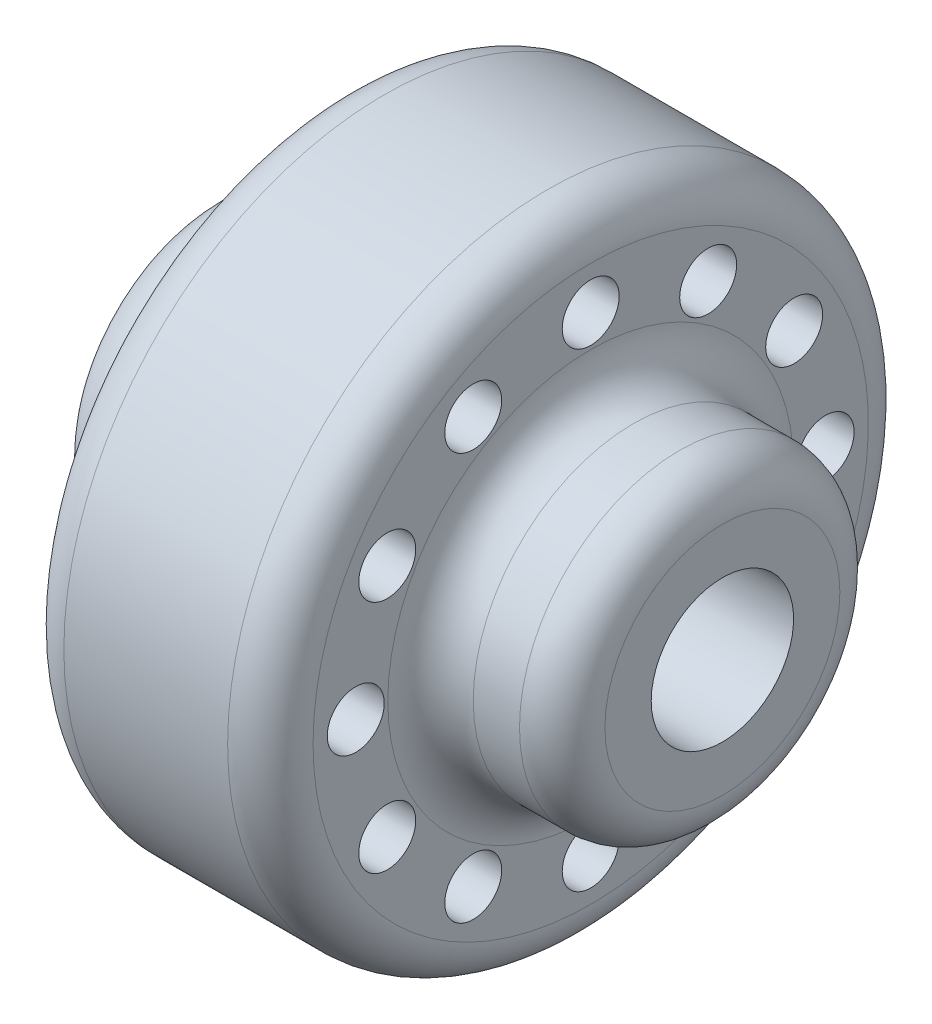
ISO-10303-21;
HEADER;
FILE_DESCRIPTION(('STEP AP214'),'2;1');
FILE_NAME('part.step','',(''),(''),'','','');
FILE_SCHEMA(('AUTOMOTIVE_DESIGN { 1 0 10303 214 1 1 1 1 }'));
ENDSEC;
DATA;
#1=APPLICATION_CONTEXT('core data for automotive mechanical design processes');
#2=APPLICATION_PROTOCOL_DEFINITION('international standard','automotive_design',2000,#1);
#3=PRODUCT_CONTEXT('',#1,'mechanical');
#4=PRODUCT('Part','Part','',(#3));
#5=PRODUCT_RELATED_PRODUCT_CATEGORY('part','',(#4));
#6=PRODUCT_DEFINITION_FORMATION('','',#4);
#7=PRODUCT_DEFINITION_CONTEXT('part definition',#1,'design');
#8=PRODUCT_DEFINITION('design','',#6,#7);
#9=PRODUCT_DEFINITION_SHAPE('','',#8);
#10=(LENGTH_UNIT() NAMED_UNIT(*) SI_UNIT(.MILLI.,.METRE.));
#11=(NAMED_UNIT(*) PLANE_ANGLE_UNIT() SI_UNIT($,.RADIAN.));
#12=(NAMED_UNIT(*) SI_UNIT($,.STERADIAN.) SOLID_ANGLE_UNIT());
#13=UNCERTAINTY_MEASURE_WITH_UNIT(LENGTH_MEASURE(1.E-05),#10,'distance_accuracy_value','');
#14=(GEOMETRIC_REPRESENTATION_CONTEXT(3) GLOBAL_UNCERTAINTY_ASSIGNED_CONTEXT((#13)) GLOBAL_UNIT_ASSIGNED_CONTEXT((#10,
#11,#12)) REPRESENTATION_CONTEXT('',''));
#15=CARTESIAN_POINT('',(0.,0.,0.));
#16=DIRECTION('',(0.,0.,1.));
#17=DIRECTION('',(1.,0.,0.));
#18=AXIS2_PLACEMENT_3D('',#15,#16,#17);
#19=CARTESIAN_POINT('',(26.75,8.25,0.));
#20=DIRECTION('',(-1.,0.,0.));
#21=DIRECTION('',(0.,0.,1.));
#22=AXIS2_PLACEMENT_3D('',#19,#20,#21);
#23=PLANE('',#22);
#24=CARTESIAN_POINT('',(26.75,0.,0.));
#25=DIRECTION('',(-1.,0.,0.));
#26=DIRECTION('',(0.,0.,1.));
#27=AXIS2_PLACEMENT_3D('',#24,#25,#26);
#28=CIRCLE('',#27,5.);
#29=CARTESIAN_POINT('',(26.75,0.,5.));
#30=VERTEX_POINT('',#29);
#31=EDGE_CURVE('E74',#30,#30,#28,.T.);
#32=ORIENTED_EDGE('',*,*,#31,.T.);
#33=EDGE_LOOP('',(#32));
#34=FACE_BOUND('',#33,.T.);
#35=CARTESIAN_POINT('',(26.75,0.,0.));
#36=DIRECTION('',(-1.,0.,0.));
#37=DIRECTION('',(0.,0.,1.));
#38=AXIS2_PLACEMENT_3D('',#35,#36,#37);
#39=CIRCLE('',#38,8.25);
#40=CARTESIAN_POINT('',(26.75,0.,8.25));
#41=VERTEX_POINT('',#40);
#42=EDGE_CURVE('E10',#41,#41,#39,.T.);
#43=ORIENTED_EDGE('',*,*,#42,.F.);
#44=EDGE_LOOP('',(#43));
#45=FACE_BOUND('',#44,.T.);
#46=ADVANCED_FACE('F31',(#34,#45),#23,.F.);
#47=CARTESIAN_POINT('',(23.75,0.,0.));
#48=DIRECTION('',(-1.,0.,0.));
#49=DIRECTION('',(0.,0.,1.));
#50=AXIS2_PLACEMENT_3D('',#47,#48,#49);
#51=TOROIDAL_SURFACE('',#50,8.25,3.);
#52=CARTESIAN_POINT('',(23.75,0.,0.));
#53=DIRECTION('',(-1.,0.,0.));
#54=DIRECTION('',(0.,0.,1.));
#55=AXIS2_PLACEMENT_3D('',#52,#53,#54);
#56=CIRCLE('',#55,11.25);
#57=CARTESIAN_POINT('',(23.75,0.,11.25));
#58=VERTEX_POINT('',#57);
#59=EDGE_CURVE('E37',#58,#58,#56,.T.);
#60=ORIENTED_EDGE('',*,*,#59,.F.);
#61=EDGE_LOOP('',(#60));
#62=FACE_BOUND('',#61,.T.);
#63=ORIENTED_EDGE('',*,*,#42,.T.);
#64=EDGE_LOOP('',(#63));
#65=FACE_BOUND('',#64,.T.);
#66=ADVANCED_FACE('F205',(#62,#65),#51,.T.);
#67=CARTESIAN_POINT('',(25.,0.,0.));
#68=DIRECTION('',(-1.,0.,0.));
#69=DIRECTION('',(0.,0.,1.));
#70=AXIS2_PLACEMENT_3D('',#67,#68,#69);
#71=CYLINDRICAL_SURFACE('',#70,11.25);
#72=CARTESIAN_POINT('',(20.5,0.,0.));
#73=DIRECTION('',(-1.,0.,0.));
#74=DIRECTION('',(0.,0.,1.));
#75=AXIS2_PLACEMENT_3D('',#72,#73,#74);
#76=CIRCLE('',#75,11.25);
#77=CARTESIAN_POINT('',(20.5,0.,11.25));
#78=VERTEX_POINT('',#77);
#79=EDGE_CURVE('E41',#78,#78,#76,.T.);
#80=ORIENTED_EDGE('',*,*,#79,.F.);
#81=EDGE_LOOP('',(#80));
#82=FACE_BOUND('',#81,.T.);
#83=ORIENTED_EDGE('',*,*,#59,.T.);
#84=EDGE_LOOP('',(#83));
#85=FACE_BOUND('',#84,.T.);
#86=ADVANCED_FACE('F200',(#82,#85),#71,.T.);
#87=CARTESIAN_POINT('',(20.5,0.,0.));
#88=DIRECTION('',(-1.,0.,0.));
#89=DIRECTION('',(0.,0.,1.));
#90=AXIS2_PLACEMENT_3D('',#87,#88,#89);
#91=TOROIDAL_SURFACE('',#90,14.25,3.);
#92=CARTESIAN_POINT('',(17.5,0.,0.));
#93=DIRECTION('',(-1.,0.,0.));
#94=DIRECTION('',(0.,0.,1.));
#95=AXIS2_PLACEMENT_3D('',#92,#93,#94);
#96=CIRCLE('',#95,14.25);
#97=CARTESIAN_POINT('',(17.5,0.,14.25));
#98=VERTEX_POINT('',#97);
#99=EDGE_CURVE('E45',#98,#98,#96,.T.);
#100=ORIENTED_EDGE('',*,*,#99,.F.);
#101=EDGE_LOOP('',(#100));
#102=FACE_BOUND('',#101,.T.);
#103=ORIENTED_EDGE('',*,*,#79,.T.);
#104=EDGE_LOOP('',(#103));
#105=FACE_BOUND('',#104,.T.);
#106=ADVANCED_FACE('F193',(#102,#105),#91,.F.);
#107=CARTESIAN_POINT('',(17.5,19.5,0.));
#108=DIRECTION('',(-1.,0.,0.));
#109=DIRECTION('',(0.,0.,1.));
#110=AXIS2_PLACEMENT_3D('',#107,#108,#109);
#111=PLANE('',#110);
#112=CARTESIAN_POINT('',(17.5,8.24999999999997,-14.2894191624433));
#113=DIRECTION('',(-1.,0.,0.));
#114=DIRECTION('',(0.,0.,1.));
#115=AXIS2_PLACEMENT_3D('',#112,#113,#114);
#116=CIRCLE('',#115,2.);
#117=CARTESIAN_POINT('',(17.5,8.24999999999997,-12.2894191624433));
#118=VERTEX_POINT('',#117);
#119=EDGE_CURVE('E86',#118,#118,#116,.T.);
#120=ORIENTED_EDGE('',*,*,#119,.T.);
#121=EDGE_LOOP('',(#120));
#122=FACE_BOUND('',#121,.T.);
#123=CARTESIAN_POINT('',(17.5,0.,-16.5));
#124=DIRECTION('',(-1.,0.,0.));
#125=DIRECTION('',(0.,0.,1.));
#126=AXIS2_PLACEMENT_3D('',#123,#124,#125);
#127=CIRCLE('',#126,2.);
#128=CARTESIAN_POINT('',(17.5,0.,-14.5));
#129=VERTEX_POINT('',#128);
#130=EDGE_CURVE('E89',#129,#129,#127,.T.);
#131=ORIENTED_EDGE('',*,*,#130,.T.);
#132=EDGE_LOOP('',(#131));
#133=FACE_BOUND('',#132,.T.);
#134=CARTESIAN_POINT('',(17.5,-8.25000000000007,-14.2894191624432));
#135=DIRECTION('',(-1.,0.,0.));
#136=DIRECTION('',(0.,0.,1.));
#137=AXIS2_PLACEMENT_3D('',#134,#135,#136);
#138=CIRCLE('',#137,2.);
#139=CARTESIAN_POINT('',(17.5,-8.25000000000007,-12.2894191624432));
#140=VERTEX_POINT('',#139);
#141=EDGE_CURVE('E92',#140,#140,#138,.T.);
#142=ORIENTED_EDGE('',*,*,#141,.T.);
#143=EDGE_LOOP('',(#142));
#144=FACE_BOUND('',#143,.T.);
#145=CARTESIAN_POINT('',(17.5,-14.2894191624433,-8.24999999999992));
#146=DIRECTION('',(-1.,0.,0.));
#147=DIRECTION('',(0.,0.,1.));
#148=AXIS2_PLACEMENT_3D('',#145,#146,#147);
#149=CIRCLE('',#148,2.);
#150=CARTESIAN_POINT('',(17.5,-14.2894191624433,-6.24999999999992));
#151=VERTEX_POINT('',#150);
#152=EDGE_CURVE('E95',#151,#151,#149,.T.);
#153=ORIENTED_EDGE('',*,*,#152,.T.);
#154=EDGE_LOOP('',(#153));
#155=FACE_BOUND('',#154,.T.);
#156=CARTESIAN_POINT('',(17.5,-16.5,0.));
#157=DIRECTION('',(-1.,0.,0.));
#158=DIRECTION('',(0.,0.,1.));
#159=AXIS2_PLACEMENT_3D('',#156,#157,#158);
#160=CIRCLE('',#159,2.);
#161=CARTESIAN_POINT('',(17.5,-16.5,2.));
#162=VERTEX_POINT('',#161);
#163=EDGE_CURVE('E98',#162,#162,#160,.T.);
#164=ORIENTED_EDGE('',*,*,#163,.T.);
#165=EDGE_LOOP('',(#164));
#166=FACE_BOUND('',#165,.T.);
#167=CARTESIAN_POINT('',(17.5,-14.2894191624432,8.25000000000012));
#168=DIRECTION('',(-1.,0.,0.));
#169=DIRECTION('',(0.,0.,1.));
#170=AXIS2_PLACEMENT_3D('',#167,#168,#169);
#171=CIRCLE('',#170,2.);
#172=CARTESIAN_POINT('',(17.5,-14.2894191624432,10.2500000000001));
#173=VERTEX_POINT('',#172);
#174=EDGE_CURVE('E101',#173,#173,#171,.T.);
#175=ORIENTED_EDGE('',*,*,#174,.T.);
#176=EDGE_LOOP('',(#175));
#177=FACE_BOUND('',#176,.T.);
#178=CARTESIAN_POINT('',(17.5,-8.24999999999987,14.2894191624433));
#179=DIRECTION('',(-1.,0.,0.));
#180=DIRECTION('',(0.,0.,1.));
#181=AXIS2_PLACEMENT_3D('',#178,#179,#180);
#182=CIRCLE('',#181,2.);
#183=CARTESIAN_POINT('',(17.5,-8.24999999999987,16.2894191624433));
#184=VERTEX_POINT('',#183);
#185=EDGE_CURVE('E104',#184,#184,#182,.T.);
#186=ORIENTED_EDGE('',*,*,#185,.T.);
#187=EDGE_LOOP('',(#186));
#188=FACE_BOUND('',#187,.T.);
#189=CARTESIAN_POINT('',(17.5,1.72828326272735E-13,16.5));
#190=DIRECTION('',(-1.,0.,0.));
#191=DIRECTION('',(0.,0.,1.));
#192=AXIS2_PLACEMENT_3D('',#189,#190,#191);
#193=CIRCLE('',#192,2.);
#194=CARTESIAN_POINT('',(17.5,1.72828326272735E-13,18.5));
#195=VERTEX_POINT('',#194);
#196=EDGE_CURVE('E107',#195,#195,#193,.T.);
#197=ORIENTED_EDGE('',*,*,#196,.T.);
#198=EDGE_LOOP('',(#197));
#199=FACE_BOUND('',#198,.T.);
#200=CARTESIAN_POINT('',(17.5,8.25000000000017,14.2894191624431));
#201=DIRECTION('',(-1.,0.,0.));
#202=DIRECTION('',(0.,0.,1.));
#203=AXIS2_PLACEMENT_3D('',#200,#201,#202);
#204=CIRCLE('',#203,2.);
#205=CARTESIAN_POINT('',(17.5,8.25000000000017,16.2894191624431));
#206=VERTEX_POINT('',#205);
#207=EDGE_CURVE('E110',#206,#206,#204,.T.);
#208=ORIENTED_EDGE('',*,*,#207,.T.);
#209=EDGE_LOOP('',(#208));
#210=FACE_BOUND('',#209,.T.);
#211=CARTESIAN_POINT('',(17.5,14.2894191624433,8.24999999999982));
#212=DIRECTION('',(-1.,0.,0.));
#213=DIRECTION('',(0.,0.,1.));
#214=AXIS2_PLACEMENT_3D('',#211,#212,#213);
#215=CIRCLE('',#214,2.);
#216=CARTESIAN_POINT('',(17.5,14.2894191624433,10.2499999999998));
#217=VERTEX_POINT('',#216);
#218=EDGE_CURVE('E113',#217,#217,#215,.T.);
#219=ORIENTED_EDGE('',*,*,#218,.T.);
#220=EDGE_LOOP('',(#219));
#221=FACE_BOUND('',#220,.T.);
#222=CARTESIAN_POINT('',(17.5,14.2894191624432,-8.25000000000002));
#223=DIRECTION('',(-1.,0.,0.));
#224=DIRECTION('',(0.,0.,1.));
#225=AXIS2_PLACEMENT_3D('',#222,#223,#224);
#226=CIRCLE('',#225,2.);
#227=CARTESIAN_POINT('',(17.5,14.2894191624432,-6.25000000000002));
#228=VERTEX_POINT('',#227);
#229=EDGE_CURVE('E116',#228,#228,#226,.T.);
#230=ORIENTED_EDGE('',*,*,#229,.T.);
#231=EDGE_LOOP('',(#230));
#232=FACE_BOUND('',#231,.T.);
#233=CARTESIAN_POINT('',(17.5,16.5,0.));
#234=DIRECTION('',(-1.,0.,0.));
#235=DIRECTION('',(0.,0.,1.));
#236=AXIS2_PLACEMENT_3D('',#233,#234,#235);
#237=CIRCLE('',#236,2.);
#238=CARTESIAN_POINT('',(17.5,16.5,2.));
#239=VERTEX_POINT('',#238);
#240=EDGE_CURVE('E78',#239,#239,#237,.T.);
#241=ORIENTED_EDGE('',*,*,#240,.T.);
#242=EDGE_LOOP('',(#241));
#243=FACE_BOUND('',#242,.T.);
#244=CARTESIAN_POINT('',(17.5,0.,0.));
#245=DIRECTION('',(-1.,0.,0.));
#246=DIRECTION('',(0.,0.,1.));
#247=AXIS2_PLACEMENT_3D('',#244,#245,#246);
#248=CIRCLE('',#247,19.5);
#249=CARTESIAN_POINT('',(17.5,0.,19.5));
#250=VERTEX_POINT('',#249);
#251=EDGE_CURVE('E50',#250,#250,#248,.T.);
#252=ORIENTED_EDGE('',*,*,#251,.F.);
#253=EDGE_LOOP('',(#252));
#254=FACE_BOUND('',#253,.T.);
#255=ORIENTED_EDGE('',*,*,#99,.T.);
#256=EDGE_LOOP('',(#255));
#257=FACE_BOUND('',#256,.T.);
#258=ADVANCED_FACE('F187',(#122,#133,#144,#155,#166,#177,#188,#199,#210,#221,#232,#243,#254,
#257),#111,.F.);
#259=CARTESIAN_POINT('',(14.5,0.,0.));
#260=DIRECTION('',(-1.,0.,0.));
#261=DIRECTION('',(0.,0.,1.));
#262=AXIS2_PLACEMENT_3D('',#259,#260,#261);
#263=TOROIDAL_SURFACE('',#262,19.5,3.);
#264=CARTESIAN_POINT('',(14.5,0.,0.));
#265=DIRECTION('',(-1.,0.,0.));
#266=DIRECTION('',(0.,0.,1.));
#267=AXIS2_PLACEMENT_3D('',#264,#265,#266);
#268=CIRCLE('',#267,22.5);
#269=CARTESIAN_POINT('',(14.5,0.,22.5));
#270=VERTEX_POINT('',#269);
#271=EDGE_CURVE('E53',#270,#270,#268,.T.);
#272=ORIENTED_EDGE('',*,*,#271,.F.);
#273=EDGE_LOOP('',(#272));
#274=FACE_BOUND('',#273,.T.);
#275=ORIENTED_EDGE('',*,*,#251,.T.);
#276=EDGE_LOOP('',(#275));
#277=FACE_BOUND('',#276,.T.);
#278=ADVANCED_FACE('F181',(#274,#277),#263,.T.);
#279=CARTESIAN_POINT('',(25.,0.,0.));
#280=DIRECTION('',(-1.,0.,0.));
#281=DIRECTION('',(0.,0.,1.));
#282=AXIS2_PLACEMENT_3D('',#279,#280,#281);
#283=CYLINDRICAL_SURFACE('',#282,22.5);
#284=CARTESIAN_POINT('',(3.,0.,0.));
#285=DIRECTION('',(-1.,0.,0.));
#286=DIRECTION('',(0.,0.,1.));
#287=AXIS2_PLACEMENT_3D('',#284,#285,#286);
#288=CIRCLE('',#287,22.5);
#289=CARTESIAN_POINT('',(3.,0.,22.5));
#290=VERTEX_POINT('',#289);
#291=EDGE_CURVE('E56',#290,#290,#288,.T.);
#292=ORIENTED_EDGE('',*,*,#291,.F.);
#293=EDGE_LOOP('',(#292));
#294=FACE_BOUND('',#293,.T.);
#295=ORIENTED_EDGE('',*,*,#271,.T.);
#296=EDGE_LOOP('',(#295));
#297=FACE_BOUND('',#296,.T.);
#298=ADVANCED_FACE('F175',(#294,#297),#283,.T.);
#299=CARTESIAN_POINT('',(3.,0.,0.));
#300=DIRECTION('',(-1.,0.,0.));
#301=DIRECTION('',(0.,0.,1.));
#302=AXIS2_PLACEMENT_3D('',#299,#300,#301);
#303=TOROIDAL_SURFACE('',#302,19.5,3.);
#304=CARTESIAN_POINT('',(0.,0.,0.));
#305=DIRECTION('',(-1.,0.,0.));
#306=DIRECTION('',(0.,0.,1.));
#307=AXIS2_PLACEMENT_3D('',#304,#305,#306);
#308=CIRCLE('',#307,19.5);
#309=CARTESIAN_POINT('',(0.,0.,19.5));
#310=VERTEX_POINT('',#309);
#311=EDGE_CURVE('E59',#310,#310,#308,.T.);
#312=ORIENTED_EDGE('',*,*,#311,.F.);
#313=EDGE_LOOP('',(#312));
#314=FACE_BOUND('',#313,.T.);
#315=ORIENTED_EDGE('',*,*,#291,.T.);
#316=EDGE_LOOP('',(#315));
#317=FACE_BOUND('',#316,.T.);
#318=ADVANCED_FACE('F160',(#314,#317),#303,.T.);
#319=CARTESIAN_POINT('',(0.,19.5,0.));
#320=DIRECTION('',(1.,0.,0.));
#321=DIRECTION('',(0.,0.,-1.));
#322=AXIS2_PLACEMENT_3D('',#319,#320,#321);
#323=PLANE('',#322);
#324=CARTESIAN_POINT('',(0.,8.24999999999997,-14.2894191624433));
#325=DIRECTION('',(-1.,0.,0.));
#326=DIRECTION('',(0.,0.86602540378444,0.499999999999998));
#327=AXIS2_PLACEMENT_3D('',#324,#325,#326);
#328=CIRCLE('',#327,2.);
#329=CARTESIAN_POINT('',(0.,9.98205080756885,-13.2894191624433));
#330=VERTEX_POINT('',#329);
#331=EDGE_CURVE('E122',#330,#330,#328,.T.);
#332=ORIENTED_EDGE('',*,*,#331,.F.);
#333=EDGE_LOOP('',(#332));
#334=FACE_BOUND('',#333,.T.);
#335=CARTESIAN_POINT('',(0.,0.,-16.5));
#336=DIRECTION('',(-1.,0.,0.));
#337=DIRECTION('',(0.,1.,0.));
#338=AXIS2_PLACEMENT_3D('',#335,#336,#337);
#339=CIRCLE('',#338,2.);
#340=CARTESIAN_POINT('',(0.,1.99999999999994,-16.5));
#341=VERTEX_POINT('',#340);
#342=EDGE_CURVE('E142',#341,#341,#339,.T.);
#343=ORIENTED_EDGE('',*,*,#342,.F.);
#344=EDGE_LOOP('',(#343));
#345=FACE_BOUND('',#344,.T.);
#346=CARTESIAN_POINT('',(0.,-8.25000000000007,-14.2894191624432));
#347=DIRECTION('',(-1.,0.,0.));
#348=DIRECTION('',(0.,0.866025403784436,-0.500000000000004));
#349=AXIS2_PLACEMENT_3D('',#346,#347,#348);
#350=CIRCLE('',#349,2.);
#351=CARTESIAN_POINT('',(0.,-6.51794919243119,-15.2894191624432));
#352=VERTEX_POINT('',#351);
#353=EDGE_CURVE('E139',#352,#352,#350,.T.);
#354=ORIENTED_EDGE('',*,*,#353,.F.);
#355=EDGE_LOOP('',(#354));
#356=FACE_BOUND('',#355,.T.);
#357=CARTESIAN_POINT('',(0.,-14.2894191624433,-8.24999999999992));
#358=DIRECTION('',(-1.,0.,0.));
#359=DIRECTION('',(0.,0.499999999999995,-0.866025403784442));
#360=AXIS2_PLACEMENT_3D('',#357,#358,#359);
#361=CIRCLE('',#360,2.);
#362=CARTESIAN_POINT('',(0.,-13.2894191624433,-9.9820508075688));
#363=VERTEX_POINT('',#362);
#364=EDGE_CURVE('E136',#363,#363,#361,.T.);
#365=ORIENTED_EDGE('',*,*,#364,.F.);
#366=EDGE_LOOP('',(#365));
#367=FACE_BOUND('',#366,.T.);
#368=CARTESIAN_POINT('',(0.,-16.5,0.));
#369=DIRECTION('',(-1.,0.,0.));
#370=DIRECTION('',(0.,0.,-1.));
#371=AXIS2_PLACEMENT_3D('',#368,#369,#370);
#372=CIRCLE('',#371,2.);
#373=CARTESIAN_POINT('',(0.,-16.5,-2.));
#374=VERTEX_POINT('',#373);
#375=EDGE_CURVE('E133',#374,#374,#372,.T.);
#376=ORIENTED_EDGE('',*,*,#375,.F.);
#377=EDGE_LOOP('',(#376));
#378=FACE_BOUND('',#377,.T.);
#379=CARTESIAN_POINT('',(0.,-14.2894191624432,8.25000000000012));
#380=DIRECTION('',(-1.,0.,0.));
#381=DIRECTION('',(0.,-0.500000000000007,-0.866025403784435));
#382=AXIS2_PLACEMENT_3D('',#379,#380,#381);
#383=CIRCLE('',#382,2.);
#384=CARTESIAN_POINT('',(0.,-15.2894191624432,6.51794919243125));
#385=VERTEX_POINT('',#384);
#386=EDGE_CURVE('E130',#385,#385,#383,.T.);
#387=ORIENTED_EDGE('',*,*,#386,.F.);
#388=EDGE_LOOP('',(#387));
#389=FACE_BOUND('',#388,.T.);
#390=CARTESIAN_POINT('',(0.,-8.24999999999987,14.2894191624433));
#391=DIRECTION('',(-1.,0.,0.));
#392=DIRECTION('',(0.,-0.866025403784443,-0.499999999999992));
#393=AXIS2_PLACEMENT_3D('',#390,#391,#392);
#394=CIRCLE('',#393,2.);
#395=CARTESIAN_POINT('',(0.,-9.98205080756875,13.2894191624433));
#396=VERTEX_POINT('',#395);
#397=EDGE_CURVE('E126',#396,#396,#394,.T.);
#398=ORIENTED_EDGE('',*,*,#397,.F.);
#399=EDGE_LOOP('',(#398));
#400=FACE_BOUND('',#399,.T.);
#401=CARTESIAN_POINT('',(0.,1.72828326272735E-13,16.5));
#402=DIRECTION('',(-1.,0.,0.));
#403=DIRECTION('',(0.,-1.,0.));
#404=AXIS2_PLACEMENT_3D('',#401,#402,#403);
#405=CIRCLE('',#404,2.);
#406=CARTESIAN_POINT('',(0.,-1.99999999999983,16.5));
#407=VERTEX_POINT('',#406);
#408=EDGE_CURVE('E123',#407,#407,#405,.T.);
#409=ORIENTED_EDGE('',*,*,#408,.F.);
#410=EDGE_LOOP('',(#409));
#411=FACE_BOUND('',#410,.T.);
#412=CARTESIAN_POINT('',(0.,8.25000000000017,14.2894191624431));
#413=DIRECTION('',(-1.,0.,0.));
#414=DIRECTION('',(0.,-0.866025403784433,0.50000000000001));
#415=AXIS2_PLACEMENT_3D('',#412,#413,#414);
#416=CIRCLE('',#415,2.);
#417=CARTESIAN_POINT('',(0.,6.5179491924313,15.2894191624432));
#418=VERTEX_POINT('',#417);
#419=EDGE_CURVE('E127',#418,#418,#416,.T.);
#420=ORIENTED_EDGE('',*,*,#419,.F.);
#421=EDGE_LOOP('',(#420));
#422=FACE_BOUND('',#421,.T.);
#423=CARTESIAN_POINT('',(0.,14.2894191624433,8.24999999999982));
#424=DIRECTION('',(-1.,0.,0.));
#425=DIRECTION('',(0.,-0.499999999999989,0.866025403784445));
#426=AXIS2_PLACEMENT_3D('',#423,#424,#425);
#427=CIRCLE('',#426,2.);
#428=CARTESIAN_POINT('',(0.,13.2894191624434,9.98205080756871));
#429=VERTEX_POINT('',#428);
#430=EDGE_CURVE('E147',#429,#429,#427,.T.);
#431=ORIENTED_EDGE('',*,*,#430,.F.);
#432=EDGE_LOOP('',(#431));
#433=FACE_BOUND('',#432,.T.);
#434=CARTESIAN_POINT('',(0.,14.2894191624432,-8.25000000000002));
#435=DIRECTION('',(-1.,0.,0.));
#436=DIRECTION('',(0.,0.500000000000001,0.866025403784438));
#437=AXIS2_PLACEMENT_3D('',#434,#435,#436);
#438=CIRCLE('',#437,2.);
#439=CARTESIAN_POINT('',(0.,15.2894191624432,-6.51794919243114));
#440=VERTEX_POINT('',#439);
#441=EDGE_CURVE('E119',#440,#440,#438,.T.);
#442=ORIENTED_EDGE('',*,*,#441,.F.);
#443=EDGE_LOOP('',(#442));
#444=FACE_BOUND('',#443,.T.);
#445=CARTESIAN_POINT('',(0.,16.5,0.));
#446=DIRECTION('',(-1.,0.,0.));
#447=DIRECTION('',(0.,0.,1.));
#448=AXIS2_PLACEMENT_3D('',#445,#446,#447);
#449=CIRCLE('',#448,2.);
#450=CARTESIAN_POINT('',(0.,16.5,2.));
#451=VERTEX_POINT('',#450);
#452=EDGE_CURVE('E83',#451,#451,#449,.T.);
#453=ORIENTED_EDGE('',*,*,#452,.F.);
#454=EDGE_LOOP('',(#453));
#455=FACE_BOUND('',#454,.T.);
#456=CARTESIAN_POINT('',(0.,0.,0.));
#457=DIRECTION('',(-1.,0.,0.));
#458=DIRECTION('',(0.,0.,1.));
#459=AXIS2_PLACEMENT_3D('',#456,#457,#458);
#460=CIRCLE('',#459,14.25);
#461=CARTESIAN_POINT('',(0.,0.,14.25));
#462=VERTEX_POINT('',#461);
#463=EDGE_CURVE('E62',#462,#462,#460,.T.);
#464=ORIENTED_EDGE('',*,*,#463,.F.);
#465=EDGE_LOOP('',(#464));
#466=FACE_BOUND('',#465,.T.);
#467=ORIENTED_EDGE('',*,*,#311,.T.);
#468=EDGE_LOOP('',(#467));
#469=FACE_BOUND('',#468,.T.);
#470=ADVANCED_FACE('F156',(#334,#345,#356,#367,#378,#389,#400,#411,#422,#433,#444,#455,#466,
#469),#323,.F.);
#471=CARTESIAN_POINT('',(-3.,0.,0.));
#472=DIRECTION('',(-1.,0.,0.));
#473=DIRECTION('',(0.,0.,1.));
#474=AXIS2_PLACEMENT_3D('',#471,#472,#473);
#475=TOROIDAL_SURFACE('',#474,14.25,3.);
#476=CARTESIAN_POINT('',(-3.,0.,0.));
#477=DIRECTION('',(-1.,0.,0.));
#478=DIRECTION('',(0.,0.,1.));
#479=AXIS2_PLACEMENT_3D('',#476,#477,#478);
#480=CIRCLE('',#479,11.25);
#481=CARTESIAN_POINT('',(-3.,0.,11.25));
#482=VERTEX_POINT('',#481);
#483=EDGE_CURVE('E65',#482,#482,#480,.T.);
#484=ORIENTED_EDGE('',*,*,#483,.F.);
#485=EDGE_LOOP('',(#484));
#486=FACE_BOUND('',#485,.T.);
#487=ORIENTED_EDGE('',*,*,#463,.T.);
#488=EDGE_LOOP('',(#487));
#489=FACE_BOUND('',#488,.T.);
#490=ADVANCED_FACE('F159',(#486,#489),#475,.F.);
#491=CARTESIAN_POINT('',(25.,0.,0.));
#492=DIRECTION('',(-1.,0.,0.));
#493=DIRECTION('',(0.,0.,1.));
#494=AXIS2_PLACEMENT_3D('',#491,#492,#493);
#495=CYLINDRICAL_SURFACE('',#494,11.25);
#496=CARTESIAN_POINT('',(-6.25,0.,0.));
#497=DIRECTION('',(-1.,0.,0.));
#498=DIRECTION('',(0.,0.,1.));
#499=AXIS2_PLACEMENT_3D('',#496,#497,#498);
#500=CIRCLE('',#499,11.25);
#501=CARTESIAN_POINT('',(-6.25,0.,11.25));
#502=VERTEX_POINT('',#501);
#503=EDGE_CURVE('E68',#502,#502,#500,.T.);
#504=ORIENTED_EDGE('',*,*,#503,.F.);
#505=EDGE_LOOP('',(#504));
#506=FACE_BOUND('',#505,.T.);
#507=ORIENTED_EDGE('',*,*,#483,.T.);
#508=EDGE_LOOP('',(#507));
#509=FACE_BOUND('',#508,.T.);
#510=ADVANCED_FACE('F234',(#506,#509),#495,.T.);
#511=CARTESIAN_POINT('',(-6.25,0.,0.));
#512=DIRECTION('',(-1.,0.,0.));
#513=DIRECTION('',(0.,0.,1.));
#514=AXIS2_PLACEMENT_3D('',#511,#512,#513);
#515=TOROIDAL_SURFACE('',#514,8.25,3.);
#516=CARTESIAN_POINT('',(-9.24999999999999,0.,0.));
#517=DIRECTION('',(-1.,0.,0.));
#518=DIRECTION('',(0.,0.,1.));
#519=AXIS2_PLACEMENT_3D('',#516,#517,#518);
#520=CIRCLE('',#519,8.25);
#521=CARTESIAN_POINT('',(-9.24999999999999,0.,8.25));
#522=VERTEX_POINT('',#521);
#523=EDGE_CURVE('E71',#522,#522,#520,.T.);
#524=ORIENTED_EDGE('',*,*,#523,.F.);
#525=EDGE_LOOP('',(#524));
#526=FACE_BOUND('',#525,.T.);
#527=ORIENTED_EDGE('',*,*,#503,.T.);
#528=EDGE_LOOP('',(#527));
#529=FACE_BOUND('',#528,.T.);
#530=ADVANCED_FACE('F228',(#526,#529),#515,.T.);
#531=CARTESIAN_POINT('',(-9.24999999999999,8.25,0.));
#532=DIRECTION('',(1.,0.,0.));
#533=DIRECTION('',(0.,0.,-1.));
#534=AXIS2_PLACEMENT_3D('',#531,#532,#533);
#535=PLANE('',#534);
#536=CARTESIAN_POINT('',(-9.24999999999999,0.,0.));
#537=DIRECTION('',(-1.,0.,0.));
#538=DIRECTION('',(0.,0.,1.));
#539=AXIS2_PLACEMENT_3D('',#536,#537,#538);
#540=CIRCLE('',#539,5.);
#541=CARTESIAN_POINT('',(-9.24999999999999,0.,5.));
#542=VERTEX_POINT('',#541);
#543=EDGE_CURVE('E75',#542,#542,#540,.T.);
#544=ORIENTED_EDGE('',*,*,#543,.F.);
#545=EDGE_LOOP('',(#544));
#546=FACE_BOUND('',#545,.T.);
#547=ORIENTED_EDGE('',*,*,#523,.T.);
#548=EDGE_LOOP('',(#547));
#549=FACE_BOUND('',#548,.T.);
#550=ADVANCED_FACE('F222',(#546,#549),#535,.F.);
#551=CARTESIAN_POINT('',(26.75,0.,0.));
#552=DIRECTION('',(-1.,0.,0.));
#553=DIRECTION('',(0.,0.,1.));
#554=AXIS2_PLACEMENT_3D('',#551,#552,#553);
#555=CYLINDRICAL_SURFACE('',#554,5.);
#556=ORIENTED_EDGE('',*,*,#31,.F.);
#557=EDGE_LOOP('',(#556));
#558=FACE_BOUND('',#557,.T.);
#559=ORIENTED_EDGE('',*,*,#543,.T.);
#560=EDGE_LOOP('',(#559));
#561=FACE_BOUND('',#560,.T.);
#562=ADVANCED_FACE('F218',(#558,#561),#555,.F.);
#563=CARTESIAN_POINT('',(26.75,16.5,0.));
#564=DIRECTION('',(-1.,0.,0.));
#565=DIRECTION('',(0.,0.,1.));
#566=AXIS2_PLACEMENT_3D('',#563,#564,#565);
#567=CYLINDRICAL_SURFACE('',#566,2.);
#568=ORIENTED_EDGE('',*,*,#452,.T.);
#569=EDGE_LOOP('',(#568));
#570=FACE_BOUND('',#569,.T.);
#571=ORIENTED_EDGE('',*,*,#240,.F.);
#572=EDGE_LOOP('',(#571));
#573=FACE_BOUND('',#572,.T.);
#574=ADVANCED_FACE('F221',(#570,#573),#567,.F.);
#575=CARTESIAN_POINT('',(26.75,14.2894191624432,-8.25000000000002));
#576=DIRECTION('',(-1.,0.,0.));
#577=DIRECTION('',(0.,0.,1.));
#578=AXIS2_PLACEMENT_3D('',#575,#576,#577);
#579=CYLINDRICAL_SURFACE('',#578,2.);
#580=ORIENTED_EDGE('',*,*,#441,.T.);
#581=EDGE_LOOP('',(#580));
#582=FACE_BOUND('',#581,.T.);
#583=ORIENTED_EDGE('',*,*,#229,.F.);
#584=EDGE_LOOP('',(#583));
#585=FACE_BOUND('',#584,.T.);
#586=ADVANCED_FACE('F252',(#582,#585),#579,.F.);
#587=CARTESIAN_POINT('',(26.75,14.2894191624433,8.24999999999982));
#588=DIRECTION('',(-1.,0.,0.));
#589=DIRECTION('',(0.,0.,1.));
#590=AXIS2_PLACEMENT_3D('',#587,#588,#589);
#591=CYLINDRICAL_SURFACE('',#590,2.);
#592=ORIENTED_EDGE('',*,*,#430,.T.);
#593=EDGE_LOOP('',(#592));
#594=FACE_BOUND('',#593,.T.);
#595=ORIENTED_EDGE('',*,*,#218,.F.);
#596=EDGE_LOOP('',(#595));
#597=FACE_BOUND('',#596,.T.);
#598=ADVANCED_FACE('F256',(#594,#597),#591,.F.);
#599=CARTESIAN_POINT('',(26.75,8.25000000000017,14.2894191624431));
#600=DIRECTION('',(-1.,0.,0.));
#601=DIRECTION('',(0.,0.,1.));
#602=AXIS2_PLACEMENT_3D('',#599,#600,#601);
#603=CYLINDRICAL_SURFACE('',#602,2.);
#604=ORIENTED_EDGE('',*,*,#419,.T.);
#605=EDGE_LOOP('',(#604));
#606=FACE_BOUND('',#605,.T.);
#607=ORIENTED_EDGE('',*,*,#207,.F.);
#608=EDGE_LOOP('',(#607));
#609=FACE_BOUND('',#608,.T.);
#610=ADVANCED_FACE('F153',(#606,#609),#603,.F.);
#611=CARTESIAN_POINT('',(26.75,1.72828326272735E-13,16.5));
#612=DIRECTION('',(-1.,0.,0.));
#613=DIRECTION('',(0.,0.,1.));
#614=AXIS2_PLACEMENT_3D('',#611,#612,#613);
#615=CYLINDRICAL_SURFACE('',#614,2.);
#616=ORIENTED_EDGE('',*,*,#408,.T.);
#617=EDGE_LOOP('',(#616));
#618=FACE_BOUND('',#617,.T.);
#619=ORIENTED_EDGE('',*,*,#196,.F.);
#620=EDGE_LOOP('',(#619));
#621=FACE_BOUND('',#620,.T.);
#622=ADVANCED_FACE('F258',(#618,#621),#615,.F.);
#623=CARTESIAN_POINT('',(26.75,-8.24999999999987,14.2894191624433));
#624=DIRECTION('',(-1.,0.,0.));
#625=DIRECTION('',(0.,0.,1.));
#626=AXIS2_PLACEMENT_3D('',#623,#624,#625);
#627=CYLINDRICAL_SURFACE('',#626,2.);
#628=ORIENTED_EDGE('',*,*,#397,.T.);
#629=EDGE_LOOP('',(#628));
#630=FACE_BOUND('',#629,.T.);
#631=ORIENTED_EDGE('',*,*,#185,.F.);
#632=EDGE_LOOP('',(#631));
#633=FACE_BOUND('',#632,.T.);
#634=ADVANCED_FACE('F261',(#630,#633),#627,.F.);
#635=CARTESIAN_POINT('',(26.75,-14.2894191624432,8.25000000000012));
#636=DIRECTION('',(-1.,0.,0.));
#637=DIRECTION('',(0.,0.,1.));
#638=AXIS2_PLACEMENT_3D('',#635,#636,#637);
#639=CYLINDRICAL_SURFACE('',#638,2.);
#640=ORIENTED_EDGE('',*,*,#386,.T.);
#641=EDGE_LOOP('',(#640));
#642=FACE_BOUND('',#641,.T.);
#643=ORIENTED_EDGE('',*,*,#174,.F.);
#644=EDGE_LOOP('',(#643));
#645=FACE_BOUND('',#644,.T.);
#646=ADVANCED_FACE('F265',(#642,#645),#639,.F.);
#647=CARTESIAN_POINT('',(26.75,-16.5,0.));
#648=DIRECTION('',(-1.,0.,0.));
#649=DIRECTION('',(0.,0.,1.));
#650=AXIS2_PLACEMENT_3D('',#647,#648,#649);
#651=CYLINDRICAL_SURFACE('',#650,2.);
#652=ORIENTED_EDGE('',*,*,#375,.T.);
#653=EDGE_LOOP('',(#652));
#654=FACE_BOUND('',#653,.T.);
#655=ORIENTED_EDGE('',*,*,#163,.F.);
#656=EDGE_LOOP('',(#655));
#657=FACE_BOUND('',#656,.T.);
#658=ADVANCED_FACE('F269',(#654,#657),#651,.F.);
#659=CARTESIAN_POINT('',(26.75,-14.2894191624433,-8.24999999999992));
#660=DIRECTION('',(-1.,0.,0.));
#661=DIRECTION('',(0.,0.,1.));
#662=AXIS2_PLACEMENT_3D('',#659,#660,#661);
#663=CYLINDRICAL_SURFACE('',#662,2.);
#664=ORIENTED_EDGE('',*,*,#364,.T.);
#665=EDGE_LOOP('',(#664));
#666=FACE_BOUND('',#665,.T.);
#667=ORIENTED_EDGE('',*,*,#152,.F.);
#668=EDGE_LOOP('',(#667));
#669=FACE_BOUND('',#668,.T.);
#670=ADVANCED_FACE('F273',(#666,#669),#663,.F.);
#671=CARTESIAN_POINT('',(26.75,-8.25000000000007,-14.2894191624432));
#672=DIRECTION('',(-1.,0.,0.));
#673=DIRECTION('',(0.,0.,1.));
#674=AXIS2_PLACEMENT_3D('',#671,#672,#673);
#675=CYLINDRICAL_SURFACE('',#674,2.);
#676=ORIENTED_EDGE('',*,*,#353,.T.);
#677=EDGE_LOOP('',(#676));
#678=FACE_BOUND('',#677,.T.);
#679=ORIENTED_EDGE('',*,*,#141,.F.);
#680=EDGE_LOOP('',(#679));
#681=FACE_BOUND('',#680,.T.);
#682=ADVANCED_FACE('F277',(#678,#681),#675,.F.);
#683=CARTESIAN_POINT('',(26.75,0.,-16.5));
#684=DIRECTION('',(-1.,0.,0.));
#685=DIRECTION('',(0.,0.,1.));
#686=AXIS2_PLACEMENT_3D('',#683,#684,#685);
#687=CYLINDRICAL_SURFACE('',#686,2.);
#688=ORIENTED_EDGE('',*,*,#342,.T.);
#689=EDGE_LOOP('',(#688));
#690=FACE_BOUND('',#689,.T.);
#691=ORIENTED_EDGE('',*,*,#130,.F.);
#692=EDGE_LOOP('',(#691));
#693=FACE_BOUND('',#692,.T.);
#694=ADVANCED_FACE('F281',(#690,#693),#687,.F.);
#695=CARTESIAN_POINT('',(26.75,8.24999999999997,-14.2894191624433));
#696=DIRECTION('',(-1.,0.,0.));
#697=DIRECTION('',(0.,0.,1.));
#698=AXIS2_PLACEMENT_3D('',#695,#696,#697);
#699=CYLINDRICAL_SURFACE('',#698,2.);
#700=ORIENTED_EDGE('',*,*,#331,.T.);
#701=EDGE_LOOP('',(#700));
#702=FACE_BOUND('',#701,.T.);
#703=ORIENTED_EDGE('',*,*,#119,.F.);
#704=EDGE_LOOP('',(#703));
#705=FACE_BOUND('',#704,.T.);
#706=ADVANCED_FACE('F285',(#702,#705),#699,.F.);
#707=CLOSED_SHELL('',(#46,#66,#86,#106,#258,#278,#298,#318,#470,#490,#510,#530,#550,#562,#574,
#586,#598,#610,#622,#634,#646,#658,#670,#682,#694,#706));
#708=MANIFOLD_SOLID_BREP('B2',#707);
#709=ADVANCED_BREP_SHAPE_REPRESENTATION('',(#18,#708),#14);
#710=SHAPE_DEFINITION_REPRESENTATION(#9,#709);
ENDSEC;
END-ISO-10303-21;
